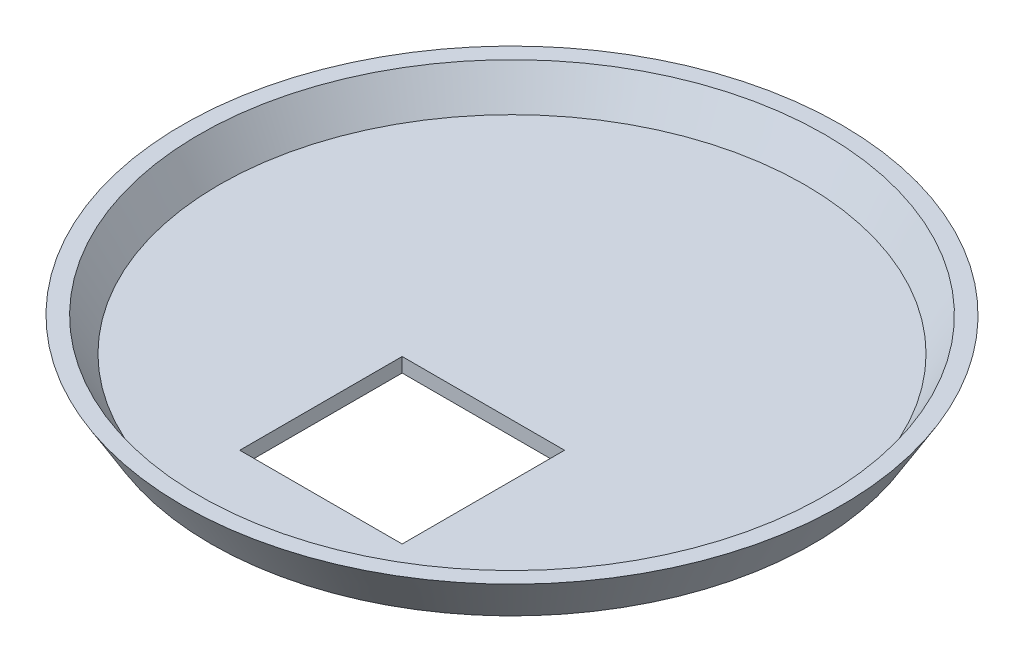
ISO-10303-21;
HEADER;
FILE_DESCRIPTION(('STEP AP214'),'2;1');
FILE_NAME('part.step','',(''),(''),'','','');
FILE_SCHEMA(('AUTOMOTIVE_DESIGN { 1 0 10303 214 1 1 1 1 }'));
ENDSEC;
DATA;
#1=APPLICATION_CONTEXT('core data for automotive mechanical design processes');
#2=APPLICATION_PROTOCOL_DEFINITION('international standard','automotive_design',2000,#1);
#3=PRODUCT_CONTEXT('',#1,'mechanical');
#4=PRODUCT('Part','Part','',(#3));
#5=PRODUCT_RELATED_PRODUCT_CATEGORY('part','',(#4));
#6=PRODUCT_DEFINITION_FORMATION('','',#4);
#7=PRODUCT_DEFINITION_CONTEXT('part definition',#1,'design');
#8=PRODUCT_DEFINITION('design','',#6,#7);
#9=PRODUCT_DEFINITION_SHAPE('','',#8);
#10=(LENGTH_UNIT() NAMED_UNIT(*) SI_UNIT(.MILLI.,.METRE.));
#11=(NAMED_UNIT(*) PLANE_ANGLE_UNIT() SI_UNIT($,.RADIAN.));
#12=(NAMED_UNIT(*) SI_UNIT($,.STERADIAN.) SOLID_ANGLE_UNIT());
#13=UNCERTAINTY_MEASURE_WITH_UNIT(LENGTH_MEASURE(1.E-05),#10,'distance_accuracy_value','');
#14=(GEOMETRIC_REPRESENTATION_CONTEXT(3) GLOBAL_UNCERTAINTY_ASSIGNED_CONTEXT((#13)) GLOBAL_UNIT_ASSIGNED_CONTEXT((#10,
#11,#12)) REPRESENTATION_CONTEXT('',''));
#15=CARTESIAN_POINT('',(0.,0.,0.));
#16=DIRECTION('',(0.,0.,1.));
#17=DIRECTION('',(1.,0.,0.));
#18=AXIS2_PLACEMENT_3D('',#15,#16,#17);
#19=CARTESIAN_POINT('',(0.,3.,0.));
#20=DIRECTION('',(0.,1.,0.));
#21=DIRECTION('',(0.,0.,1.));
#22=AXIS2_PLACEMENT_3D('',#19,#20,#21);
#23=PLANE('',#22);
#24=DIRECTION('',(0.,0.,1.));
#25=VECTOR('',#24,1.);
#26=CARTESIAN_POINT('',(-11.,3.,0.));
#27=LINE('',#26,#25);
#28=CARTESIAN_POINT('',(-11.,3.,12.));
#29=VERTEX_POINT('',#28);
#30=CARTESIAN_POINT('',(-11.,3.,46.));
#31=VERTEX_POINT('',#30);
#32=EDGE_CURVE('E114',#29,#31,#27,.T.);
#33=ORIENTED_EDGE('',*,*,#32,.F.);
#34=DIRECTION('',(-1.,0.,0.));
#35=VECTOR('',#34,1.);
#36=CARTESIAN_POINT('',(0.,3.,12.));
#37=LINE('',#36,#35);
#38=CARTESIAN_POINT('',(23.,3.,12.));
#39=VERTEX_POINT('',#38);
#40=EDGE_CURVE('E107',#39,#29,#37,.T.);
#41=ORIENTED_EDGE('',*,*,#40,.F.);
#42=DIRECTION('',(0.,0.,-1.));
#43=VECTOR('',#42,1.);
#44=CARTESIAN_POINT('',(23.,3.,0.));
#45=LINE('',#44,#43);
#46=CARTESIAN_POINT('',(23.,3.,46.));
#47=VERTEX_POINT('',#46);
#48=EDGE_CURVE('E87',#47,#39,#45,.T.);
#49=ORIENTED_EDGE('',*,*,#48,.F.);
#50=DIRECTION('',(1.,0.,0.));
#51=VECTOR('',#50,1.);
#52=CARTESIAN_POINT('',(0.,3.,46.));
#53=LINE('',#52,#51);
#54=EDGE_CURVE('E112',#31,#47,#53,.T.);
#55=ORIENTED_EDGE('',*,*,#54,.F.);
#56=EDGE_LOOP('',(#33,#41,#49,#55));
#57=FACE_BOUND('',#56,.T.);
#58=CARTESIAN_POINT('',(0.,3.,0.));
#59=DIRECTION('',(0.,-1.,0.));
#60=DIRECTION('',(0.,0.,-1.));
#61=AXIS2_PLACEMENT_3D('',#58,#59,#60);
#62=CIRCLE('',#61,61.3014288630928);
#63=CARTESIAN_POINT('',(0.,3.,-61.3014288630928));
#64=VERTEX_POINT('',#63);
#65=EDGE_CURVE('E11',#64,#64,#62,.T.);
#66=ORIENTED_EDGE('',*,*,#65,.F.);
#67=EDGE_LOOP('',(#66));
#68=FACE_BOUND('',#67,.T.);
#69=ADVANCED_FACE('F41',(#57,#68),#23,.T.);
#70=CARTESIAN_POINT('',(0.,10.,0.));
#71=DIRECTION('',(0.,1.,0.));
#72=DIRECTION('',(0.,0.,1.));
#73=AXIS2_PLACEMENT_3D('',#70,#71,#72);
#74=CONICAL_SURFACE('',#73,65.5014288630928,0.540419500270584);
#75=ORIENTED_EDGE('',*,*,#65,.T.);
#76=EDGE_LOOP('',(#75));
#77=FACE_BOUND('',#76,.T.);
#78=CARTESIAN_POINT('',(0.,10.,0.));
#79=DIRECTION('',(0.,-1.,0.));
#80=DIRECTION('',(0.,0.,-1.));
#81=AXIS2_PLACEMENT_3D('',#78,#79,#80);
#82=CIRCLE('',#81,65.5014288630928);
#83=CARTESIAN_POINT('',(0.,10.,-65.5014288630928));
#84=VERTEX_POINT('',#83);
#85=EDGE_CURVE('E48',#84,#84,#82,.T.);
#86=ORIENTED_EDGE('',*,*,#85,.F.);
#87=EDGE_LOOP('',(#86));
#88=FACE_BOUND('',#87,.T.);
#89=ADVANCED_FACE('F127',(#77,#88),#74,.F.);
#90=CARTESIAN_POINT('',(69.,10.,0.));
#91=DIRECTION('',(0.,1.,0.));
#92=DIRECTION('',(0.,0.,1.));
#93=AXIS2_PLACEMENT_3D('',#90,#91,#92);
#94=PLANE('',#93);
#95=ORIENTED_EDGE('',*,*,#85,.T.);
#96=EDGE_LOOP('',(#95));
#97=FACE_BOUND('',#96,.T.);
#98=CARTESIAN_POINT('',(0.,10.,0.));
#99=DIRECTION('',(0.,-1.,0.));
#100=DIRECTION('',(0.,0.,-1.));
#101=AXIS2_PLACEMENT_3D('',#98,#99,#100);
#102=CIRCLE('',#101,69.);
#103=CARTESIAN_POINT('',(0.,10.,-69.));
#104=VERTEX_POINT('',#103);
#105=EDGE_CURVE('E119',#104,#104,#102,.T.);
#106=ORIENTED_EDGE('',*,*,#105,.F.);
#107=EDGE_LOOP('',(#106));
#108=FACE_BOUND('',#107,.T.);
#109=ADVANCED_FACE('F124',(#97,#108),#94,.T.);
#110=CARTESIAN_POINT('',(0.,0.,0.));
#111=DIRECTION('',(0.,1.,0.));
#112=DIRECTION('',(0.,0.,1.));
#113=AXIS2_PLACEMENT_3D('',#110,#111,#112);
#114=CONICAL_SURFACE('',#113,63.,0.540419500270584);
#115=ORIENTED_EDGE('',*,*,#105,.T.);
#116=EDGE_LOOP('',(#115));
#117=FACE_BOUND('',#116,.T.);
#118=CARTESIAN_POINT('',(0.,0.,0.));
#119=DIRECTION('',(0.,-1.,0.));
#120=DIRECTION('',(0.,0.,-1.));
#121=AXIS2_PLACEMENT_3D('',#118,#119,#120);
#122=CIRCLE('',#121,63.);
#123=CARTESIAN_POINT('',(0.,0.,-63.));
#124=VERTEX_POINT('',#123);
#125=EDGE_CURVE('E116',#124,#124,#122,.T.);
#126=ORIENTED_EDGE('',*,*,#125,.F.);
#127=EDGE_LOOP('',(#126));
#128=FACE_BOUND('',#127,.T.);
#129=ADVANCED_FACE('F133',(#117,#128),#114,.T.);
#130=CARTESIAN_POINT('',(0.,0.,0.));
#131=DIRECTION('',(0.,-1.,0.));
#132=DIRECTION('',(0.,0.,-1.));
#133=AXIS2_PLACEMENT_3D('',#130,#131,#132);
#134=PLANE('',#133);
#135=DIRECTION('',(0.,0.,-1.));
#136=VECTOR('',#135,1.);
#137=CARTESIAN_POINT('',(-11.,0.,46.));
#138=LINE('',#137,#136);
#139=CARTESIAN_POINT('',(-11.,0.,46.));
#140=VERTEX_POINT('',#139);
#141=CARTESIAN_POINT('',(-11.,0.,12.));
#142=VERTEX_POINT('',#141);
#143=EDGE_CURVE('E63',#140,#142,#138,.T.);
#144=ORIENTED_EDGE('',*,*,#143,.F.);
#145=DIRECTION('',(-1.,0.,0.));
#146=VECTOR('',#145,1.);
#147=CARTESIAN_POINT('',(-11.,0.,46.));
#148=LINE('',#147,#146);
#149=CARTESIAN_POINT('',(23.,0.,46.));
#150=VERTEX_POINT('',#149);
#151=EDGE_CURVE('E100',#150,#140,#148,.T.);
#152=ORIENTED_EDGE('',*,*,#151,.F.);
#153=DIRECTION('',(0.,0.,1.));
#154=VECTOR('',#153,1.);
#155=CARTESIAN_POINT('',(23.,0.,46.));
#156=LINE('',#155,#154);
#157=CARTESIAN_POINT('',(23.,0.,12.));
#158=VERTEX_POINT('',#157);
#159=EDGE_CURVE('E84',#158,#150,#156,.T.);
#160=ORIENTED_EDGE('',*,*,#159,.F.);
#161=DIRECTION('',(1.,0.,0.));
#162=VECTOR('',#161,1.);
#163=CARTESIAN_POINT('',(-11.,0.,12.));
#164=LINE('',#163,#162);
#165=EDGE_CURVE('E93',#142,#158,#164,.T.);
#166=ORIENTED_EDGE('',*,*,#165,.F.);
#167=EDGE_LOOP('',(#144,#152,#160,#166));
#168=FACE_BOUND('',#167,.T.);
#169=ORIENTED_EDGE('',*,*,#125,.T.);
#170=EDGE_LOOP('',(#169));
#171=FACE_BOUND('',#170,.T.);
#172=ADVANCED_FACE('F97',(#168,#171),#134,.T.);
#173=CARTESIAN_POINT('',(-11.,10.,46.));
#174=DIRECTION('',(-1.,0.,0.));
#175=DIRECTION('',(0.,0.,1.));
#176=AXIS2_PLACEMENT_3D('',#173,#174,#175);
#177=PLANE('',#176);
#178=ORIENTED_EDGE('',*,*,#32,.T.);
#179=DIRECTION('',(0.,-1.,0.));
#180=VECTOR('',#179,1.);
#181=CARTESIAN_POINT('',(-11.,10.,46.));
#182=LINE('',#181,#180);
#183=EDGE_CURVE('E105',#31,#140,#182,.T.);
#184=ORIENTED_EDGE('',*,*,#183,.T.);
#185=ORIENTED_EDGE('',*,*,#143,.T.);
#186=DIRECTION('',(0.,-1.,0.));
#187=VECTOR('',#186,1.);
#188=CARTESIAN_POINT('',(-11.,10.,12.));
#189=LINE('',#188,#187);
#190=EDGE_CURVE('E90',#29,#142,#189,.T.);
#191=ORIENTED_EDGE('',*,*,#190,.F.);
#192=EDGE_LOOP('',(#178,#184,#185,#191));
#193=FACE_BOUND('',#192,.T.);
#194=ADVANCED_FACE('F143',(#193),#177,.F.);
#195=CARTESIAN_POINT('',(-11.,10.,46.));
#196=DIRECTION('',(0.,0.,1.));
#197=DIRECTION('',(1.,0.,0.));
#198=AXIS2_PLACEMENT_3D('',#195,#196,#197);
#199=PLANE('',#198);
#200=ORIENTED_EDGE('',*,*,#54,.T.);
#201=DIRECTION('',(0.,-1.,0.));
#202=VECTOR('',#201,1.);
#203=CARTESIAN_POINT('',(23.,10.,46.));
#204=LINE('',#203,#202);
#205=EDGE_CURVE('E89',#47,#150,#204,.T.);
#206=ORIENTED_EDGE('',*,*,#205,.T.);
#207=ORIENTED_EDGE('',*,*,#151,.T.);
#208=ORIENTED_EDGE('',*,*,#183,.F.);
#209=EDGE_LOOP('',(#200,#206,#207,#208));
#210=FACE_BOUND('',#209,.T.);
#211=ADVANCED_FACE('F146',(#210),#199,.F.);
#212=CARTESIAN_POINT('',(23.,10.,46.));
#213=DIRECTION('',(1.,0.,0.));
#214=DIRECTION('',(0.,0.,-1.));
#215=AXIS2_PLACEMENT_3D('',#212,#213,#214);
#216=PLANE('',#215);
#217=ORIENTED_EDGE('',*,*,#48,.T.);
#218=DIRECTION('',(0.,-1.,0.));
#219=VECTOR('',#218,1.);
#220=CARTESIAN_POINT('',(23.,10.,12.));
#221=LINE('',#220,#219);
#222=EDGE_CURVE('E55',#39,#158,#221,.T.);
#223=ORIENTED_EDGE('',*,*,#222,.T.);
#224=ORIENTED_EDGE('',*,*,#159,.T.);
#225=ORIENTED_EDGE('',*,*,#205,.F.);
#226=EDGE_LOOP('',(#217,#223,#224,#225));
#227=FACE_BOUND('',#226,.T.);
#228=ADVANCED_FACE('F81',(#227),#216,.F.);
#229=CARTESIAN_POINT('',(-11.,10.,12.));
#230=DIRECTION('',(0.,0.,-1.));
#231=DIRECTION('',(-1.,0.,0.));
#232=AXIS2_PLACEMENT_3D('',#229,#230,#231);
#233=PLANE('',#232);
#234=ORIENTED_EDGE('',*,*,#40,.T.);
#235=ORIENTED_EDGE('',*,*,#190,.T.);
#236=ORIENTED_EDGE('',*,*,#165,.T.);
#237=ORIENTED_EDGE('',*,*,#222,.F.);
#238=EDGE_LOOP('',(#234,#235,#236,#237));
#239=FACE_BOUND('',#238,.T.);
#240=ADVANCED_FACE('F94',(#239),#233,.F.);
#241=CLOSED_SHELL('',(#69,#89,#109,#129,#172,#194,#211,#228,#240));
#242=MANIFOLD_SOLID_BREP('B2',#241);
#243=ADVANCED_BREP_SHAPE_REPRESENTATION('',(#18,#242),#14);
#244=SHAPE_DEFINITION_REPRESENTATION(#9,#243);
ENDSEC;
END-ISO-10303-21;
